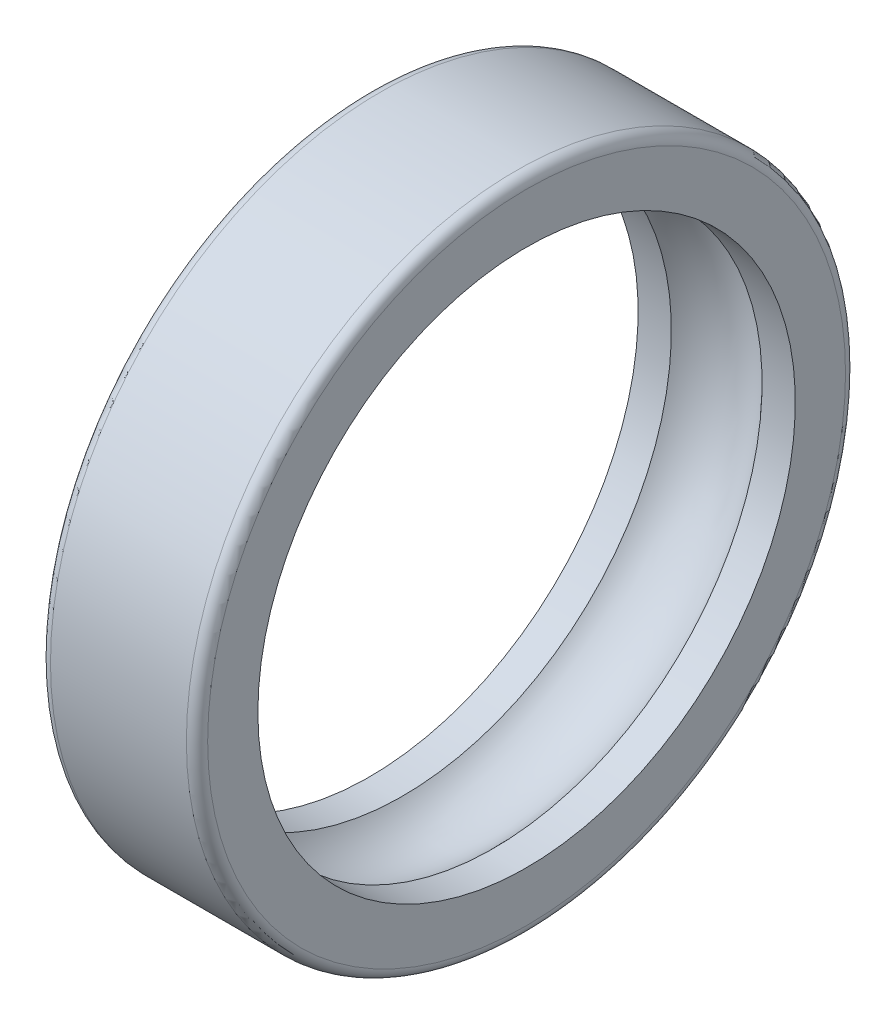
ISO-10303-21;
HEADER;
FILE_DESCRIPTION(('STEP AP214'),'2;1');
FILE_NAME('part.step','',(''),(''),'','','');
FILE_SCHEMA(('AUTOMOTIVE_DESIGN { 1 0 10303 214 1 1 1 1 }'));
ENDSEC;
DATA;
#1=APPLICATION_CONTEXT('core data for automotive mechanical design processes');
#2=APPLICATION_PROTOCOL_DEFINITION('international standard','automotive_design',2000,#1);
#3=PRODUCT_CONTEXT('',#1,'mechanical');
#4=PRODUCT('Part','Part','',(#3));
#5=PRODUCT_RELATED_PRODUCT_CATEGORY('part','',(#4));
#6=PRODUCT_DEFINITION_FORMATION('','',#4);
#7=PRODUCT_DEFINITION_CONTEXT('part definition',#1,'design');
#8=PRODUCT_DEFINITION('design','',#6,#7);
#9=PRODUCT_DEFINITION_SHAPE('','',#8);
#10=(LENGTH_UNIT() NAMED_UNIT(*) SI_UNIT(.MILLI.,.METRE.));
#11=(NAMED_UNIT(*) PLANE_ANGLE_UNIT() SI_UNIT($,.RADIAN.));
#12=(NAMED_UNIT(*) SI_UNIT($,.STERADIAN.) SOLID_ANGLE_UNIT());
#13=UNCERTAINTY_MEASURE_WITH_UNIT(LENGTH_MEASURE(1.E-05),#10,'distance_accuracy_value','');
#14=(GEOMETRIC_REPRESENTATION_CONTEXT(3) GLOBAL_UNCERTAINTY_ASSIGNED_CONTEXT((#13)) GLOBAL_UNIT_ASSIGNED_CONTEXT((#10,
#11,#12)) REPRESENTATION_CONTEXT('',''));
#15=CARTESIAN_POINT('',(0.,0.,0.));
#16=DIRECTION('',(0.,0.,1.));
#17=DIRECTION('',(1.,0.,0.));
#18=AXIS2_PLACEMENT_3D('',#15,#16,#17);
#19=CARTESIAN_POINT('',(-1.53709025069652,0.,0.));
#20=DIRECTION('',(-1.,0.,0.));
#21=DIRECTION('',(0.,0.,1.));
#22=AXIS2_PLACEMENT_3D('',#19,#20,#21);
#23=CYLINDRICAL_SURFACE('',#22,6.36);
#24=CARTESIAN_POINT('',(1.86,0.,0.));
#25=DIRECTION('',(-1.,0.,0.));
#26=DIRECTION('',(0.,0.,1.));
#27=AXIS2_PLACEMENT_3D('',#24,#25,#26);
#28=CIRCLE('',#27,6.36);
#29=CARTESIAN_POINT('',(1.86,0.,6.36));
#30=VERTEX_POINT('',#29);
#31=EDGE_CURVE('E65',#30,#30,#28,.T.);
#32=ORIENTED_EDGE('',*,*,#31,.F.);
#33=EDGE_LOOP('',(#32));
#34=FACE_BOUND('',#33,.T.);
#35=CARTESIAN_POINT('',(1.0733126291999,0.,0.));
#36=DIRECTION('',(-1.,0.,0.));
#37=DIRECTION('',(0.,0.,1.));
#38=AXIS2_PLACEMENT_3D('',#35,#36,#37);
#39=CIRCLE('',#38,6.36);
#40=CARTESIAN_POINT('',(1.0733126291999,0.,6.36));
#41=VERTEX_POINT('',#40);
#42=EDGE_CURVE('E56',#41,#41,#39,.T.);
#43=ORIENTED_EDGE('',*,*,#42,.T.);
#44=EDGE_LOOP('',(#43));
#45=FACE_BOUND('',#44,.T.);
#46=ADVANCED_FACE('F36',(#34,#45),#23,.F.);
#47=CARTESIAN_POINT('',(0.,0.,0.));
#48=DIRECTION('',(-1.,0.,0.));
#49=DIRECTION('',(0.,0.,1.));
#50=AXIS2_PLACEMENT_3D('',#47,#48,#49);
#51=TOROIDAL_SURFACE('',#50,5.4,1.44);
#52=ORIENTED_EDGE('',*,*,#42,.F.);
#53=EDGE_LOOP('',(#52));
#54=FACE_BOUND('',#53,.T.);
#55=CARTESIAN_POINT('',(-1.0733126291999,0.,0.));
#56=DIRECTION('',(-1.,0.,0.));
#57=DIRECTION('',(0.,0.,1.));
#58=AXIS2_PLACEMENT_3D('',#55,#56,#57);
#59=CIRCLE('',#58,6.36);
#60=CARTESIAN_POINT('',(-1.0733126291999,0.,6.36));
#61=VERTEX_POINT('',#60);
#62=EDGE_CURVE('E59',#61,#61,#59,.T.);
#63=ORIENTED_EDGE('',*,*,#62,.T.);
#64=EDGE_LOOP('',(#63));
#65=FACE_BOUND('',#64,.T.);
#66=ADVANCED_FACE('F73',(#54,#65),#51,.F.);
#67=CARTESIAN_POINT('',(-1.53709025069652,0.,0.));
#68=DIRECTION('',(-1.,0.,0.));
#69=DIRECTION('',(0.,0.,1.));
#70=AXIS2_PLACEMENT_3D('',#67,#68,#69);
#71=CYLINDRICAL_SURFACE('',#70,6.36);
#72=ORIENTED_EDGE('',*,*,#62,.F.);
#73=EDGE_LOOP('',(#72));
#74=FACE_BOUND('',#73,.T.);
#75=CARTESIAN_POINT('',(-1.86,0.,0.));
#76=DIRECTION('',(-1.,0.,0.));
#77=DIRECTION('',(0.,0.,1.));
#78=AXIS2_PLACEMENT_3D('',#75,#76,#77);
#79=CIRCLE('',#78,6.36);
#80=CARTESIAN_POINT('',(-1.86,0.,6.36));
#81=VERTEX_POINT('',#80);
#82=EDGE_CURVE('E62',#81,#81,#79,.T.);
#83=ORIENTED_EDGE('',*,*,#82,.T.);
#84=EDGE_LOOP('',(#83));
#85=FACE_BOUND('',#84,.T.);
#86=ADVANCED_FACE('F79',(#74,#85),#71,.F.);
#87=CARTESIAN_POINT('',(-1.86,7.8,0.));
#88=DIRECTION('',(1.,0.,0.));
#89=DIRECTION('',(0.,0.,-1.));
#90=AXIS2_PLACEMENT_3D('',#87,#88,#89);
#91=PLANE('',#90);
#92=CARTESIAN_POINT('',(-1.86,0.,0.));
#93=DIRECTION('',(1.,0.,0.));
#94=DIRECTION('',(0.,0.,-1.));
#95=AXIS2_PLACEMENT_3D('',#92,#93,#94);
#96=CIRCLE('',#95,7.548);
#97=CARTESIAN_POINT('',(-1.86,0.,-7.548));
#98=VERTEX_POINT('',#97);
#99=EDGE_CURVE('E10',#98,#98,#96,.F.);
#100=ORIENTED_EDGE('',*,*,#99,.T.);
#101=EDGE_LOOP('',(#100));
#102=FACE_BOUND('',#101,.T.);
#103=ORIENTED_EDGE('',*,*,#82,.F.);
#104=EDGE_LOOP('',(#103));
#105=FACE_BOUND('',#104,.T.);
#106=ADVANCED_FACE('F85',(#102,#105),#91,.F.);
#107=CARTESIAN_POINT('',(-1.53709025069652,0.,0.));
#108=DIRECTION('',(-1.,0.,0.));
#109=DIRECTION('',(0.,0.,1.));
#110=AXIS2_PLACEMENT_3D('',#107,#108,#109);
#111=CYLINDRICAL_SURFACE('',#110,7.8);
#112=CARTESIAN_POINT('',(1.608,0.,0.));
#113=DIRECTION('',(-1.,0.,0.));
#114=DIRECTION('',(0.,0.,1.));
#115=AXIS2_PLACEMENT_3D('',#112,#113,#114);
#116=CIRCLE('',#115,7.8);
#117=CARTESIAN_POINT('',(1.608,0.,7.8));
#118=VERTEX_POINT('',#117);
#119=EDGE_CURVE('E47',#118,#118,#116,.T.);
#120=ORIENTED_EDGE('',*,*,#119,.T.);
#121=EDGE_LOOP('',(#120));
#122=FACE_BOUND('',#121,.T.);
#123=CARTESIAN_POINT('',(-1.608,0.,0.));
#124=DIRECTION('',(1.,0.,0.));
#125=DIRECTION('',(0.,0.,-1.));
#126=AXIS2_PLACEMENT_3D('',#123,#124,#125);
#127=CIRCLE('',#126,7.8);
#128=CARTESIAN_POINT('',(-1.608,0.,-7.8));
#129=VERTEX_POINT('',#128);
#130=EDGE_CURVE('E51',#129,#129,#127,.T.);
#131=ORIENTED_EDGE('',*,*,#130,.T.);
#132=EDGE_LOOP('',(#131));
#133=FACE_BOUND('',#132,.T.);
#134=ADVANCED_FACE('F90',(#122,#133),#111,.T.);
#135=CARTESIAN_POINT('',(1.86,7.8,0.));
#136=DIRECTION('',(-1.,0.,0.));
#137=DIRECTION('',(0.,0.,1.));
#138=AXIS2_PLACEMENT_3D('',#135,#136,#137);
#139=PLANE('',#138);
#140=CARTESIAN_POINT('',(1.86,0.,0.));
#141=DIRECTION('',(-1.,0.,0.));
#142=DIRECTION('',(0.,0.,1.));
#143=AXIS2_PLACEMENT_3D('',#140,#141,#142);
#144=CIRCLE('',#143,7.548);
#145=CARTESIAN_POINT('',(1.86,0.,7.548));
#146=VERTEX_POINT('',#145);
#147=EDGE_CURVE('E43',#146,#146,#144,.F.);
#148=ORIENTED_EDGE('',*,*,#147,.T.);
#149=EDGE_LOOP('',(#148));
#150=FACE_BOUND('',#149,.T.);
#151=ORIENTED_EDGE('',*,*,#31,.T.);
#152=EDGE_LOOP('',(#151));
#153=FACE_BOUND('',#152,.T.);
#154=ADVANCED_FACE('F69',(#150,#153),#139,.F.);
#155=CARTESIAN_POINT('',(1.608,0.,0.));
#156=DIRECTION('',(-1.,0.,0.));
#157=DIRECTION('',(0.,0.,1.));
#158=AXIS2_PLACEMENT_3D('',#155,#156,#157);
#159=TOROIDAL_SURFACE('',#158,7.548,0.252);
#160=ORIENTED_EDGE('',*,*,#147,.F.);
#161=EDGE_LOOP('',(#160));
#162=FACE_BOUND('',#161,.T.);
#163=ORIENTED_EDGE('',*,*,#119,.F.);
#164=EDGE_LOOP('',(#163));
#165=FACE_BOUND('',#164,.T.);
#166=ADVANCED_FACE('F98',(#162,#165),#159,.T.);
#167=CARTESIAN_POINT('',(-1.608,0.,0.));
#168=DIRECTION('',(1.,0.,0.));
#169=DIRECTION('',(0.,0.,-1.));
#170=AXIS2_PLACEMENT_3D('',#167,#168,#169);
#171=TOROIDAL_SURFACE('',#170,7.548,0.252);
#172=ORIENTED_EDGE('',*,*,#130,.F.);
#173=EDGE_LOOP('',(#172));
#174=FACE_BOUND('',#173,.T.);
#175=ORIENTED_EDGE('',*,*,#99,.F.);
#176=EDGE_LOOP('',(#175));
#177=FACE_BOUND('',#176,.T.);
#178=ADVANCED_FACE('F38',(#174,#177),#171,.T.);
#179=CLOSED_SHELL('',(#46,#66,#86,#106,#134,#154,#166,#178));
#180=MANIFOLD_SOLID_BREP('B2',#179);
#181=ADVANCED_BREP_SHAPE_REPRESENTATION('',(#18,#180),#14);
#182=SHAPE_DEFINITION_REPRESENTATION(#9,#181);
ENDSEC;
END-ISO-10303-21;
